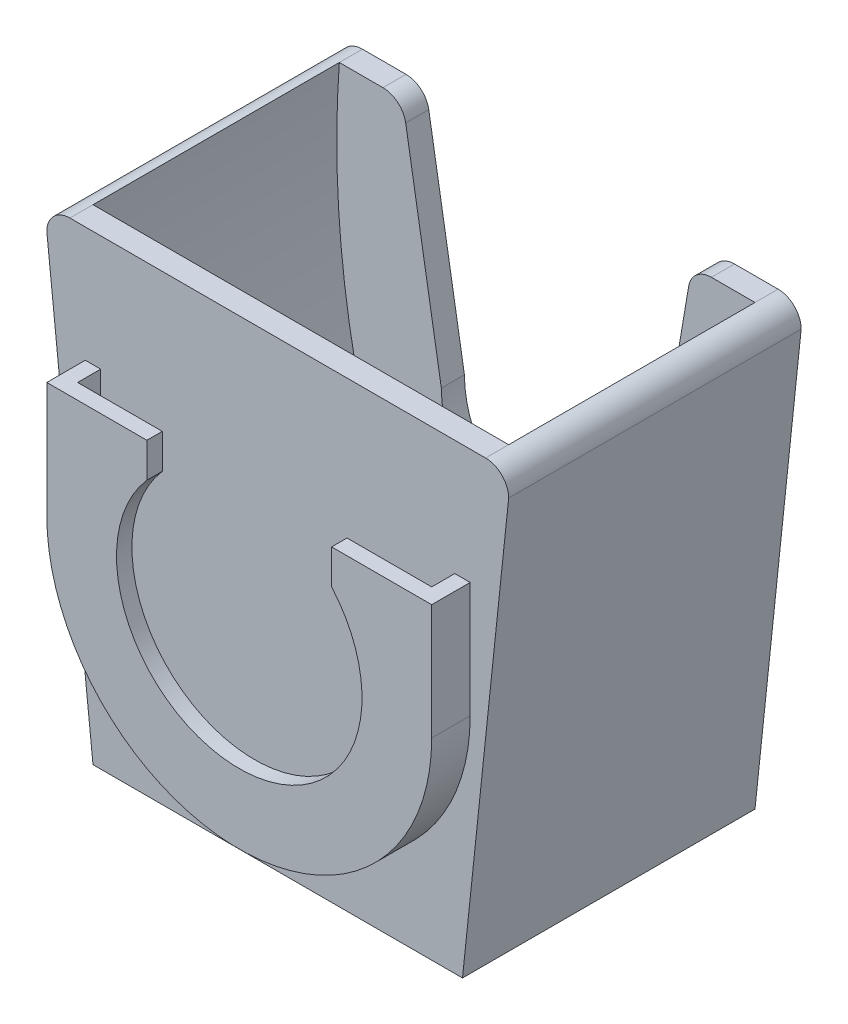
ISO-10303-21;
HEADER;
FILE_DESCRIPTION(('STEP AP214'),'2;1');
FILE_NAME('part.step','',(''),(''),'','','');
FILE_SCHEMA(('AUTOMOTIVE_DESIGN { 1 0 10303 214 1 1 1 1 }'));
ENDSEC;
DATA;
#1=APPLICATION_CONTEXT('core data for automotive mechanical design processes');
#2=APPLICATION_PROTOCOL_DEFINITION('international standard','automotive_design',2000,#1);
#3=PRODUCT_CONTEXT('',#1,'mechanical');
#4=PRODUCT('Part','Part','',(#3));
#5=PRODUCT_RELATED_PRODUCT_CATEGORY('part','',(#4));
#6=PRODUCT_DEFINITION_FORMATION('','',#4);
#7=PRODUCT_DEFINITION_CONTEXT('part definition',#1,'design');
#8=PRODUCT_DEFINITION('design','',#6,#7);
#9=PRODUCT_DEFINITION_SHAPE('','',#8);
#10=(LENGTH_UNIT() NAMED_UNIT(*) SI_UNIT(.MILLI.,.METRE.));
#11=(NAMED_UNIT(*) PLANE_ANGLE_UNIT() SI_UNIT($,.RADIAN.));
#12=(NAMED_UNIT(*) SI_UNIT($,.STERADIAN.) SOLID_ANGLE_UNIT());
#13=UNCERTAINTY_MEASURE_WITH_UNIT(LENGTH_MEASURE(1.E-05),#10,'distance_accuracy_value','');
#14=(GEOMETRIC_REPRESENTATION_CONTEXT(3) GLOBAL_UNCERTAINTY_ASSIGNED_CONTEXT((#13)) GLOBAL_UNIT_ASSIGNED_CONTEXT((#10,
#11,#12)) REPRESENTATION_CONTEXT('',''));
#15=CARTESIAN_POINT('',(0.,0.,0.));
#16=DIRECTION('',(0.,0.,1.));
#17=DIRECTION('',(1.,0.,0.));
#18=AXIS2_PLACEMENT_3D('',#15,#16,#17);
#19=CARTESIAN_POINT('',(0.,0.,23.9999999999997));
#20=DIRECTION('',(0.,0.,1.));
#21=DIRECTION('',(1.,0.,0.));
#22=AXIS2_PLACEMENT_3D('',#19,#20,#21);
#23=PLANE('',#22);
#24=DIRECTION('',(1.,0.,0.));
#25=VECTOR('',#24,1.);
#26=CARTESIAN_POINT('',(-25.0000000000001,14.9999999999998,24.));
#27=LINE('',#26,#25);
#28=CARTESIAN_POINT('',(12.,14.9999999999998,23.9999999999994));
#29=VERTEX_POINT('',#28);
#30=CARTESIAN_POINT('',(24.9999999999999,15.0000000000002,23.9999999999988));
#31=VERTEX_POINT('',#30);
#32=EDGE_CURVE('E276',#29,#31,#27,.T.);
#33=ORIENTED_EDGE('',*,*,#32,.F.);
#34=DIRECTION('',(0.,-1.,0.));
#35=VECTOR('',#34,1.);
#36=CARTESIAN_POINT('',(12.,0.,23.9999999999994));
#37=LINE('',#36,#35);
#38=CARTESIAN_POINT('',(12.,10.4999999999998,23.9999999999994));
#39=VERTEX_POINT('',#38);
#40=EDGE_CURVE('E258',#29,#39,#37,.T.);
#41=ORIENTED_EDGE('',*,*,#40,.T.);
#42=CARTESIAN_POINT('',(0.,0.,23.9999999999997));
#43=DIRECTION('',(0.,0.,1.));
#44=DIRECTION('',(1.,0.,0.));
#45=AXIS2_PLACEMENT_3D('',#42,#43,#44);
#46=CIRCLE('',#45,15.9452187191019);
#47=CARTESIAN_POINT('',(-12.,10.4999999999998,24.));
#48=VERTEX_POINT('',#47);
#49=EDGE_CURVE('E245',#48,#39,#46,.T.);
#50=ORIENTED_EDGE('',*,*,#49,.F.);
#51=DIRECTION('',(0.,-1.,0.));
#52=VECTOR('',#51,1.);
#53=CARTESIAN_POINT('',(-12.,0.,24.));
#54=LINE('',#53,#52);
#55=CARTESIAN_POINT('',(-12.,14.9999999999998,24.));
#56=VERTEX_POINT('',#55);
#57=EDGE_CURVE('E239',#56,#48,#54,.T.);
#58=ORIENTED_EDGE('',*,*,#57,.F.);
#59=CARTESIAN_POINT('',(-25.0000000000001,14.9999999999998,24.));
#60=VERTEX_POINT('',#59);
#61=EDGE_CURVE('E277',#60,#56,#27,.T.);
#62=ORIENTED_EDGE('',*,*,#61,.F.);
#63=DIRECTION('',(0.,-1.,0.));
#64=VECTOR('',#63,1.);
#65=CARTESIAN_POINT('',(-25.0000000000001,14.9999999999998,24.));
#66=LINE('',#65,#64);
#67=CARTESIAN_POINT('',(-25.,0.,24.));
#68=VERTEX_POINT('',#67);
#69=EDGE_CURVE('E327',#60,#68,#66,.T.);
#70=ORIENTED_EDGE('',*,*,#69,.T.);
#71=CARTESIAN_POINT('',(0.,0.,23.9999999999994));
#72=DIRECTION('',(0.,0.,-1.));
#73=DIRECTION('',(-1.,0.,0.));
#74=AXIS2_PLACEMENT_3D('',#71,#72,#73);
#75=CIRCLE('',#74,25.);
#76=CARTESIAN_POINT('',(25.,1.74574066942157E-13,23.9999999999988));
#77=VERTEX_POINT('',#76);
#78=EDGE_CURVE('E356',#77,#68,#75,.T.);
#79=ORIENTED_EDGE('',*,*,#78,.F.);
#80=DIRECTION('',(0.,-1.,0.));
#81=VECTOR('',#80,1.);
#82=CARTESIAN_POINT('',(24.9999999999999,15.0000000000002,23.9999999999988));
#83=LINE('',#82,#81);
#84=EDGE_CURVE('E323',#31,#77,#83,.T.);
#85=ORIENTED_EDGE('',*,*,#84,.F.);
#86=EDGE_LOOP('',(#33,#41,#50,#58,#62,#70,#79,#85));
#87=FACE_BOUND('',#86,.T.);
#88=ADVANCED_FACE('F39',(#87),#23,.T.);
#89=CARTESIAN_POINT('',(22.9999999999999,1.60608141586784E-13,21.9999999999992));
#90=DIRECTION('',(0.,0.,-1.));
#91=DIRECTION('',(-1.,0.,0.));
#92=AXIS2_PLACEMENT_3D('',#89,#90,#91);
#93=PLANE('',#92);
#94=CARTESIAN_POINT('',(0.,0.,21.9999999999997));
#95=DIRECTION('',(0.,0.,1.));
#96=DIRECTION('',(1.,0.,0.));
#97=AXIS2_PLACEMENT_3D('',#94,#95,#96);
#98=CIRCLE('',#97,15.9452187191019);
#99=CARTESIAN_POINT('',(-12.,10.4999999999998,22.));
#100=VERTEX_POINT('',#99);
#101=CARTESIAN_POINT('',(12.,10.4999999999998,21.9999999999994));
#102=VERTEX_POINT('',#101);
#103=EDGE_CURVE('E238',#100,#102,#98,.T.);
#104=ORIENTED_EDGE('',*,*,#103,.T.);
#105=DIRECTION('',(0.,-1.,0.));
#106=VECTOR('',#105,1.);
#107=CARTESIAN_POINT('',(12.,0.,21.9999999999994));
#108=LINE('',#107,#106);
#109=CARTESIAN_POINT('',(12.,14.9999999999998,21.9999999999994));
#110=VERTEX_POINT('',#109);
#111=EDGE_CURVE('E226',#110,#102,#108,.T.);
#112=ORIENTED_EDGE('',*,*,#111,.F.);
#113=DIRECTION('',(-1.,0.,0.));
#114=VECTOR('',#113,1.);
#115=CARTESIAN_POINT('',(22.9999999999998,15.0000000000002,21.9999999999989));
#116=LINE('',#115,#114);
#117=CARTESIAN_POINT('',(22.9999999999998,15.0000000000002,21.9999999999989));
#118=VERTEX_POINT('',#117);
#119=EDGE_CURVE('E293',#118,#110,#116,.T.);
#120=ORIENTED_EDGE('',*,*,#119,.F.);
#121=DIRECTION('',(0.,-1.,0.));
#122=VECTOR('',#121,1.);
#123=CARTESIAN_POINT('',(22.9999999999998,15.0000000000002,21.9999999999989));
#124=LINE('',#123,#122);
#125=CARTESIAN_POINT('',(22.9999999999999,1.60608141586784E-13,21.9999999999989));
#126=VERTEX_POINT('',#125);
#127=EDGE_CURVE('E312',#118,#126,#124,.T.);
#128=ORIENTED_EDGE('',*,*,#127,.T.);
#129=CARTESIAN_POINT('',(0.,0.,21.9999999999994));
#130=DIRECTION('',(0.,0.,-1.));
#131=DIRECTION('',(-1.,0.,0.));
#132=AXIS2_PLACEMENT_3D('',#129,#130,#131);
#133=CIRCLE('',#132,22.9999999999999);
#134=CARTESIAN_POINT('',(-23.,0.,22.));
#135=VERTEX_POINT('',#134);
#136=EDGE_CURVE('E346',#126,#135,#133,.T.);
#137=ORIENTED_EDGE('',*,*,#136,.T.);
#138=DIRECTION('',(0.,-1.,0.));
#139=VECTOR('',#138,1.);
#140=CARTESIAN_POINT('',(-23.0000000000001,14.9999999999998,22.));
#141=LINE('',#140,#139);
#142=CARTESIAN_POINT('',(-23.0000000000001,14.9999999999998,22.));
#143=VERTEX_POINT('',#142);
#144=EDGE_CURVE('E308',#143,#135,#141,.T.);
#145=ORIENTED_EDGE('',*,*,#144,.F.);
#146=CARTESIAN_POINT('',(-12.,14.9999999999999,21.9999999999997));
#147=VERTEX_POINT('',#146);
#148=EDGE_CURVE('E292',#147,#143,#116,.T.);
#149=ORIENTED_EDGE('',*,*,#148,.F.);
#150=DIRECTION('',(0.,-1.,0.));
#151=VECTOR('',#150,1.);
#152=CARTESIAN_POINT('',(-12.,0.,22.));
#153=LINE('',#152,#151);
#154=EDGE_CURVE('E57',#147,#100,#153,.T.);
#155=ORIENTED_EDGE('',*,*,#154,.T.);
#156=EDGE_LOOP('',(#104,#112,#120,#128,#137,#145,#149,#155));
#157=FACE_BOUND('',#156,.T.);
#158=ADVANCED_FACE('F251',(#157),#93,.T.);
#159=CARTESIAN_POINT('',(-1.04744440165294E-13,15.,0.));
#160=DIRECTION('',(0.,1.,0.));
#161=DIRECTION('',(-1.,0.,0.));
#162=AXIS2_PLACEMENT_3D('',#159,#160,#161);
#163=PLANE('',#162);
#164=ORIENTED_EDGE('',*,*,#119,.T.);
#165=DIRECTION('',(0.,0.,1.));
#166=VECTOR('',#165,1.);
#167=CARTESIAN_POINT('',(12.,14.9999999999998,21.9999999999994));
#168=LINE('',#167,#166);
#169=EDGE_CURVE('E232',#110,#29,#168,.T.);
#170=ORIENTED_EDGE('',*,*,#169,.T.);
#171=ORIENTED_EDGE('',*,*,#32,.T.);
#172=DIRECTION('',(0.,0.,-1.));
#173=VECTOR('',#172,1.);
#174=CARTESIAN_POINT('',(24.9999999999999,15.0000000000002,23.9999999999988));
#175=LINE('',#174,#173);
#176=CARTESIAN_POINT('',(24.9999999999999,15.0000000000002,19.));
#177=VERTEX_POINT('',#176);
#178=EDGE_CURVE('E281',#31,#177,#175,.T.);
#179=ORIENTED_EDGE('',*,*,#178,.T.);
#180=DIRECTION('',(-1.,0.,-5.6031568274044E-13));
#181=VECTOR('',#180,1.);
#182=CARTESIAN_POINT('',(24.9999999999999,15.0000000000002,19.));
#183=LINE('',#182,#181);
#184=CARTESIAN_POINT('',(22.9999999999997,15.0000000000002,19.));
#185=VERTEX_POINT('',#184);
#186=EDGE_CURVE('E285',#177,#185,#183,.T.);
#187=ORIENTED_EDGE('',*,*,#186,.T.);
#188=DIRECTION('',(0.,0.,1.));
#189=VECTOR('',#188,1.);
#190=CARTESIAN_POINT('',(22.9999999999997,15.0000000000002,18.9999999999989));
#191=LINE('',#190,#189);
#192=EDGE_CURVE('E289',#185,#118,#191,.T.);
#193=ORIENTED_EDGE('',*,*,#192,.T.);
#194=EDGE_LOOP('',(#164,#170,#171,#179,#187,#193));
#195=FACE_BOUND('',#194,.T.);
#196=ADVANCED_FACE('F617',(#195),#163,.T.);
#197=CARTESIAN_POINT('',(21.3363204338814,27.,19.));
#198=DIRECTION('',(0.,0.,-1.));
#199=DIRECTION('',(-1.,0.,0.));
#200=AXIS2_PLACEMENT_3D('',#197,#198,#199);
#201=PLANE('',#200);
#202=DIRECTION('',(1.,0.,0.));
#203=VECTOR('',#202,1.);
#204=CARTESIAN_POINT('',(21.3363204338814,30.,19.));
#205=LINE('',#204,#203);
#206=CARTESIAN_POINT('',(-27.0000000000002,30.0000000000001,19.));
#207=VERTEX_POINT('',#206);
#208=CARTESIAN_POINT('',(27.,30.,19.));
#209=VERTEX_POINT('',#208);
#210=EDGE_CURVE('E424',#207,#209,#205,.T.);
#211=ORIENTED_EDGE('',*,*,#210,.F.);
#212=CARTESIAN_POINT('',(-27.,27.,19.));
#213=DIRECTION('',(0.,0.,1.));
#214=DIRECTION('',(1.,0.,0.));
#215=AXIS2_PLACEMENT_3D('',#212,#213,#214);
#216=CIRCLE('',#215,3.00000000000012);
#217=CARTESIAN_POINT('',(-30.0000000000002,27.,19.));
#218=VERTEX_POINT('',#217);
#219=EDGE_CURVE('E443',#207,#218,#216,.T.);
#220=ORIENTED_EDGE('',*,*,#219,.T.);
#221=DIRECTION('',(0.104684784518046,-0.994505452921406,0.));
#222=VECTOR('',#221,1.);
#223=CARTESIAN_POINT('',(-30.0000000000002,27.,19.));
#224=LINE('',#223,#222);
#225=CARTESIAN_POINT('',(-24.,-30.,19.));
#226=VERTEX_POINT('',#225);
#227=EDGE_CURVE('E440',#218,#226,#224,.T.);
#228=ORIENTED_EDGE('',*,*,#227,.T.);
#229=DIRECTION('',(1.,0.,0.));
#230=VECTOR('',#229,1.);
#231=CARTESIAN_POINT('',(-24.,-30.,19.));
#232=LINE('',#231,#230);
#233=CARTESIAN_POINT('',(24.,-30.,19.));
#234=VERTEX_POINT('',#233);
#235=EDGE_CURVE('E437',#226,#234,#232,.T.);
#236=ORIENTED_EDGE('',*,*,#235,.T.);
#237=DIRECTION('',(-0.104684784518043,-0.994505452921406,0.));
#238=VECTOR('',#237,1.);
#239=CARTESIAN_POINT('',(30.,27.,19.));
#240=LINE('',#239,#238);
#241=CARTESIAN_POINT('',(30.,27.,19.));
#242=VERTEX_POINT('',#241);
#243=EDGE_CURVE('E433',#242,#234,#240,.T.);
#244=ORIENTED_EDGE('',*,*,#243,.F.);
#245=CARTESIAN_POINT('',(27.,27.,19.));
#246=DIRECTION('',(0.,0.,-1.));
#247=DIRECTION('',(-1.,0.,0.));
#248=AXIS2_PLACEMENT_3D('',#245,#246,#247);
#249=CIRCLE('',#248,3.);
#250=EDGE_CURVE('E428',#209,#242,#249,.T.);
#251=ORIENTED_EDGE('',*,*,#250,.F.);
#252=EDGE_LOOP('',(#211,#220,#228,#236,#244,#251));
#253=FACE_BOUND('',#252,.T.);
#254=DIRECTION('',(0.,-1.,0.));
#255=VECTOR('',#254,1.);
#256=CARTESIAN_POINT('',(-25.0000000000001,14.9999999999998,19.));
#257=LINE('',#256,#255);
#258=CARTESIAN_POINT('',(-25.0000000000001,14.9999999999998,19.));
#259=VERTEX_POINT('',#258);
#260=CARTESIAN_POINT('',(-25.,0.,19.));
#261=VERTEX_POINT('',#260);
#262=EDGE_CURVE('E301',#259,#261,#257,.T.);
#263=ORIENTED_EDGE('',*,*,#262,.F.);
#264=DIRECTION('',(-1.,0.,0.));
#265=VECTOR('',#264,1.);
#266=CARTESIAN_POINT('',(-23.0000000000001,14.9999999999998,19.));
#267=LINE('',#266,#265);
#268=CARTESIAN_POINT('',(-23.0000000000001,14.9999999999998,19.));
#269=VERTEX_POINT('',#268);
#270=EDGE_CURVE('E65',#269,#259,#267,.T.);
#271=ORIENTED_EDGE('',*,*,#270,.F.);
#272=DIRECTION('',(0.,-1.,0.));
#273=VECTOR('',#272,1.);
#274=CARTESIAN_POINT('',(-23.0000000000001,14.9999999999998,19.));
#275=LINE('',#274,#273);
#276=CARTESIAN_POINT('',(-23.,-1.60608141586787E-13,19.));
#277=VERTEX_POINT('',#276);
#278=EDGE_CURVE('E305',#269,#277,#275,.T.);
#279=ORIENTED_EDGE('',*,*,#278,.T.);
#280=CARTESIAN_POINT('',(-1.21347784781828E-13,0.,18.9999999999994));
#281=DIRECTION('',(0.,0.,-1.));
#282=DIRECTION('',(-1.,0.,0.));
#283=AXIS2_PLACEMENT_3D('',#280,#281,#282);
#284=CIRCLE('',#283,22.9999999999999);
#285=CARTESIAN_POINT('',(22.9999999999998,1.60608141586783E-13,18.9999999999989));
#286=VERTEX_POINT('',#285);
#287=EDGE_CURVE('E349',#286,#277,#284,.T.);
#288=ORIENTED_EDGE('',*,*,#287,.F.);
#289=DIRECTION('',(0.,-1.,0.));
#290=VECTOR('',#289,1.);
#291=CARTESIAN_POINT('',(22.9999999999997,15.0000000000002,18.9999999999989));
#292=LINE('',#291,#290);
#293=EDGE_CURVE('E316',#185,#286,#292,.T.);
#294=ORIENTED_EDGE('',*,*,#293,.F.);
#295=ORIENTED_EDGE('',*,*,#186,.F.);
#296=DIRECTION('',(0.,-1.,0.));
#297=VECTOR('',#296,1.);
#298=CARTESIAN_POINT('',(24.9999999999999,15.0000000000002,19.));
#299=LINE('',#298,#297);
#300=CARTESIAN_POINT('',(25.,1.74769556607212E-13,19.));
#301=VERTEX_POINT('',#300);
#302=EDGE_CURVE('E320',#177,#301,#299,.T.);
#303=ORIENTED_EDGE('',*,*,#302,.T.);
#304=CARTESIAN_POINT('',(-1.21347784781829E-13,0.,18.9999999999994));
#305=DIRECTION('',(0.,0.,-1.));
#306=DIRECTION('',(-1.,0.,0.));
#307=AXIS2_PLACEMENT_3D('',#304,#305,#306);
#308=CIRCLE('',#307,24.9999999999999);
#309=EDGE_CURVE('E352',#301,#261,#308,.T.);
#310=ORIENTED_EDGE('',*,*,#309,.T.);
#311=EDGE_LOOP('',(#263,#271,#279,#288,#294,#295,#303,#310));
#312=FACE_BOUND('',#311,.T.);
#313=ADVANCED_FACE('F731',(#253,#312),#201,.F.);
#314=CARTESIAN_POINT('',(21.3363204338814,30.,19.));
#315=DIRECTION('',(0.,1.,0.));
#316=DIRECTION('',(0.,0.,1.));
#317=AXIS2_PLACEMENT_3D('',#314,#315,#316);
#318=PLANE('',#317);
#319=DIRECTION('',(0.,0.,-1.));
#320=VECTOR('',#319,1.);
#321=CARTESIAN_POINT('',(27.,30.,19.));
#322=LINE('',#321,#320);
#323=CARTESIAN_POINT('',(27.,30.,16.));
#324=VERTEX_POINT('',#323);
#325=EDGE_CURVE('E519',#209,#324,#322,.T.);
#326=ORIENTED_EDGE('',*,*,#325,.T.);
#327=DIRECTION('',(-1.,0.,0.));
#328=VECTOR('',#327,1.);
#329=CARTESIAN_POINT('',(27.,30.,16.));
#330=LINE('',#329,#328);
#331=CARTESIAN_POINT('',(-27.,30.,16.));
#332=VERTEX_POINT('',#331);
#333=EDGE_CURVE('E386',#324,#332,#330,.T.);
#334=ORIENTED_EDGE('',*,*,#333,.T.);
#335=DIRECTION('',(0.,0.,-1.));
#336=VECTOR('',#335,1.);
#337=CARTESIAN_POINT('',(-27.0000000000002,30.0000000000001,19.));
#338=LINE('',#337,#336);
#339=EDGE_CURVE('E501',#207,#332,#338,.T.);
#340=ORIENTED_EDGE('',*,*,#339,.F.);
#341=ORIENTED_EDGE('',*,*,#210,.T.);
#342=EDGE_LOOP('',(#326,#334,#340,#341));
#343=FACE_BOUND('',#342,.T.);
#344=ADVANCED_FACE('F598',(#343),#318,.T.);
#345=CARTESIAN_POINT('',(21.3363204338814,27.,19.));
#346=DIRECTION('',(0.,0.,-1.));
#347=DIRECTION('',(-1.,0.,0.));
#348=AXIS2_PLACEMENT_3D('',#345,#346,#347);
#349=CYLINDRICAL_SURFACE('',#348,3.);
#350=CARTESIAN_POINT('',(21.3363204338814,27.,-16.));
#351=DIRECTION('',(0.,0.,-1.));
#352=DIRECTION('',(-1.,0.,0.));
#353=AXIS2_PLACEMENT_3D('',#350,#351,#352);
#354=CIRCLE('',#353,3.);
#355=CARTESIAN_POINT('',(21.3363204338814,30.,-16.));
#356=VERTEX_POINT('',#355);
#357=CARTESIAN_POINT('',(18.377926496154,27.4979009030093,-16.));
#358=VERTEX_POINT('',#357);
#359=EDGE_CURVE('E420',#356,#358,#354,.F.);
#360=ORIENTED_EDGE('',*,*,#359,.F.);
#361=DIRECTION('',(0.,0.,-1.));
#362=VECTOR('',#361,1.);
#363=CARTESIAN_POINT('',(21.3363204338814,30.,19.));
#364=LINE('',#363,#362);
#365=CARTESIAN_POINT('',(21.3363204338814,30.,-19.));
#366=VERTEX_POINT('',#365);
#367=EDGE_CURVE('E43',#356,#366,#364,.T.);
#368=ORIENTED_EDGE('',*,*,#367,.T.);
#369=CARTESIAN_POINT('',(21.3363204338814,27.,-19.));
#370=DIRECTION('',(0.,0.,-1.));
#371=DIRECTION('',(-1.,0.,0.));
#372=AXIS2_PLACEMENT_3D('',#369,#370,#371);
#373=CIRCLE('',#372,3.);
#374=CARTESIAN_POINT('',(18.377926496154,27.4979009030093,-19.));
#375=VERTEX_POINT('',#374);
#376=EDGE_CURVE('E423',#375,#366,#373,.T.);
#377=ORIENTED_EDGE('',*,*,#376,.F.);
#378=DIRECTION('',(0.,0.,-1.));
#379=VECTOR('',#378,1.);
#380=CARTESIAN_POINT('',(18.377926496154,27.4979009030093,19.));
#381=LINE('',#380,#379);
#382=EDGE_CURVE('E11',#358,#375,#381,.T.);
#383=ORIENTED_EDGE('',*,*,#382,.F.);
#384=EDGE_LOOP('',(#360,#368,#377,#383));
#385=FACE_BOUND('',#384,.T.);
#386=ADVANCED_FACE('F41',(#385),#349,.T.);
#387=CARTESIAN_POINT('',(18.377926496154,27.4979009030093,19.));
#388=DIRECTION('',(0.986131312575814,-0.165966967669784,0.));
#389=DIRECTION('',(0.165966967669784,0.986131312575814,0.));
#390=AXIS2_PLACEMENT_3D('',#387,#388,#389);
#391=PLANE('',#390);
#392=DIRECTION('',(0.,0.,-1.));
#393=VECTOR('',#392,1.);
#394=CARTESIAN_POINT('',(13.75,0.,19.));
#395=LINE('',#394,#393);
#396=CARTESIAN_POINT('',(13.75,0.,-16.));
#397=VERTEX_POINT('',#396);
#398=CARTESIAN_POINT('',(13.75,0.,-19.));
#399=VERTEX_POINT('',#398);
#400=EDGE_CURVE('E49',#397,#399,#395,.T.);
#401=ORIENTED_EDGE('',*,*,#400,.F.);
#402=DIRECTION('',(0.165966967669784,0.986131312575814,0.));
#403=VECTOR('',#402,1.);
#404=CARTESIAN_POINT('',(18.377926496154,27.4979009030093,-16.));
#405=LINE('',#404,#403);
#406=EDGE_CURVE('E416',#397,#358,#405,.T.);
#407=ORIENTED_EDGE('',*,*,#406,.T.);
#408=ORIENTED_EDGE('',*,*,#382,.T.);
#409=DIRECTION('',(-0.165966967669784,-0.986131312575814,0.));
#410=VECTOR('',#409,1.);
#411=CARTESIAN_POINT('',(18.377926496154,27.4979009030093,-19.));
#412=LINE('',#411,#410);
#413=EDGE_CURVE('E429',#375,#399,#412,.T.);
#414=ORIENTED_EDGE('',*,*,#413,.T.);
#415=EDGE_LOOP('',(#401,#407,#408,#414));
#416=FACE_BOUND('',#415,.T.);
#417=ADVANCED_FACE('F543',(#416),#391,.F.);
#418=CARTESIAN_POINT('',(0.,0.,19.));
#419=DIRECTION('',(0.,0.,-1.));
#420=DIRECTION('',(-1.,0.,0.));
#421=AXIS2_PLACEMENT_3D('',#418,#419,#420);
#422=CYLINDRICAL_SURFACE('',#421,13.75);
#423=CARTESIAN_POINT('',(0.,0.,-16.));
#424=DIRECTION('',(0.,0.,-1.));
#425=DIRECTION('',(-1.,0.,0.));
#426=AXIS2_PLACEMENT_3D('',#423,#424,#425);
#427=CIRCLE('',#426,13.75);
#428=CARTESIAN_POINT('',(-13.75,0.,-16.));
#429=VERTEX_POINT('',#428);
#430=EDGE_CURVE('E368',#397,#429,#427,.T.);
#431=ORIENTED_EDGE('',*,*,#430,.F.);
#432=ORIENTED_EDGE('',*,*,#400,.T.);
#433=CARTESIAN_POINT('',(0.,0.,-19.));
#434=DIRECTION('',(0.,0.,1.));
#435=DIRECTION('',(1.,0.,0.));
#436=AXIS2_PLACEMENT_3D('',#433,#434,#435);
#437=CIRCLE('',#436,13.75);
#438=CARTESIAN_POINT('',(-13.75,0.,-19.));
#439=VERTEX_POINT('',#438);
#440=EDGE_CURVE('E483',#439,#399,#437,.T.);
#441=ORIENTED_EDGE('',*,*,#440,.F.);
#442=DIRECTION('',(0.,0.,-1.));
#443=VECTOR('',#442,1.);
#444=CARTESIAN_POINT('',(-13.75,0.,19.));
#445=LINE('',#444,#443);
#446=EDGE_CURVE('E492',#429,#439,#445,.T.);
#447=ORIENTED_EDGE('',*,*,#446,.F.);
#448=EDGE_LOOP('',(#431,#432,#441,#447));
#449=FACE_BOUND('',#448,.T.);
#450=ADVANCED_FACE('F550',(#449),#422,.F.);
#451=CARTESIAN_POINT('',(-18.3779264961539,27.4979009030093,19.));
#452=DIRECTION('',(0.986131312575814,0.165966967669784,0.));
#453=DIRECTION('',(-0.165966967669784,0.986131312575814,0.));
#454=AXIS2_PLACEMENT_3D('',#451,#452,#453);
#455=PLANE('',#454);
#456=DIRECTION('',(-0.165966967669784,0.986131312575814,0.));
#457=VECTOR('',#456,1.);
#458=CARTESIAN_POINT('',(-18.3779264961539,27.4979009030093,-16.));
#459=LINE('',#458,#457);
#460=CARTESIAN_POINT('',(-18.3779264961539,27.4979009030093,-16.));
#461=VERTEX_POINT('',#460);
#462=EDGE_CURVE('E413',#429,#461,#459,.T.);
#463=ORIENTED_EDGE('',*,*,#462,.F.);
#464=ORIENTED_EDGE('',*,*,#446,.T.);
#465=DIRECTION('',(0.165966967669784,-0.986131312575814,0.));
#466=VECTOR('',#465,1.);
#467=CARTESIAN_POINT('',(-18.3779264961539,27.4979009030093,-19.));
#468=LINE('',#467,#466);
#469=CARTESIAN_POINT('',(-18.3779264961539,27.4979009030093,-19.));
#470=VERTEX_POINT('',#469);
#471=EDGE_CURVE('E479',#470,#439,#468,.T.);
#472=ORIENTED_EDGE('',*,*,#471,.F.);
#473=DIRECTION('',(0.,0.,-1.));
#474=VECTOR('',#473,1.);
#475=CARTESIAN_POINT('',(-18.3779264961539,27.4979009030093,19.));
#476=LINE('',#475,#474);
#477=EDGE_CURVE('E495',#461,#470,#476,.T.);
#478=ORIENTED_EDGE('',*,*,#477,.F.);
#479=EDGE_LOOP('',(#463,#464,#472,#478));
#480=FACE_BOUND('',#479,.T.);
#481=ADVANCED_FACE('F553',(#480),#455,.T.);
#482=CARTESIAN_POINT('',(-21.3363204338814,27.,19.));
#483=DIRECTION('',(0.,0.,-1.));
#484=DIRECTION('',(-1.,0.,0.));
#485=AXIS2_PLACEMENT_3D('',#482,#483,#484);
#486=CYLINDRICAL_SURFACE('',#485,3.);
#487=CARTESIAN_POINT('',(-21.3363204338814,27.,-16.));
#488=DIRECTION('',(0.,0.,-1.));
#489=DIRECTION('',(-1.,0.,0.));
#490=AXIS2_PLACEMENT_3D('',#487,#488,#489);
#491=CIRCLE('',#490,3.);
#492=CARTESIAN_POINT('',(-21.3363204338814,30.,-16.));
#493=VERTEX_POINT('',#492);
#494=EDGE_CURVE('E399',#461,#493,#491,.F.);
#495=ORIENTED_EDGE('',*,*,#494,.F.);
#496=ORIENTED_EDGE('',*,*,#477,.T.);
#497=CARTESIAN_POINT('',(-21.3363204338814,27.,-19.));
#498=DIRECTION('',(0.,0.,-1.));
#499=DIRECTION('',(-1.,0.,0.));
#500=AXIS2_PLACEMENT_3D('',#497,#498,#499);
#501=CIRCLE('',#500,3.);
#502=CARTESIAN_POINT('',(-21.3363204338814,30.,-19.));
#503=VERTEX_POINT('',#502);
#504=EDGE_CURVE('E475',#503,#470,#501,.T.);
#505=ORIENTED_EDGE('',*,*,#504,.F.);
#506=DIRECTION('',(0.,0.,-1.));
#507=VECTOR('',#506,1.);
#508=CARTESIAN_POINT('',(-21.3363204338814,30.,19.));
#509=LINE('',#508,#507);
#510=EDGE_CURVE('E498',#493,#503,#509,.T.);
#511=ORIENTED_EDGE('',*,*,#510,.F.);
#512=EDGE_LOOP('',(#495,#496,#505,#511));
#513=FACE_BOUND('',#512,.T.);
#514=ADVANCED_FACE('F559',(#513),#486,.T.);
#515=CARTESIAN_POINT('',(-27.0000000000002,30.,19.));
#516=DIRECTION('',(0.,1.,0.));
#517=DIRECTION('',(-1.,0.,0.));
#518=AXIS2_PLACEMENT_3D('',#515,#516,#517);
#519=PLANE('',#518);
#520=DIRECTION('',(-1.,0.,0.));
#521=VECTOR('',#520,1.);
#522=CARTESIAN_POINT('',(-27.,30.,-16.));
#523=LINE('',#522,#521);
#524=CARTESIAN_POINT('',(-27.,30.,-16.));
#525=VERTEX_POINT('',#524);
#526=EDGE_CURVE('E371',#493,#525,#523,.T.);
#527=ORIENTED_EDGE('',*,*,#526,.F.);
#528=ORIENTED_EDGE('',*,*,#510,.T.);
#529=DIRECTION('',(1.,0.,0.));
#530=VECTOR('',#529,1.);
#531=CARTESIAN_POINT('',(-27.0000000000002,30.,-19.));
#532=LINE('',#531,#530);
#533=CARTESIAN_POINT('',(-27.0000000000002,30.0000000000001,-19.));
#534=VERTEX_POINT('',#533);
#535=EDGE_CURVE('E471',#534,#503,#532,.T.);
#536=ORIENTED_EDGE('',*,*,#535,.F.);
#537=EDGE_CURVE('E505',#525,#534,#338,.T.);
#538=ORIENTED_EDGE('',*,*,#537,.F.);
#539=EDGE_LOOP('',(#527,#528,#536,#538));
#540=FACE_BOUND('',#539,.T.);
#541=ADVANCED_FACE('F563',(#540),#519,.T.);
#542=CARTESIAN_POINT('',(-27.,27.,19.));
#543=DIRECTION('',(0.,0.,-1.));
#544=DIRECTION('',(-1.,0.,0.));
#545=AXIS2_PLACEMENT_3D('',#542,#543,#544);
#546=CYLINDRICAL_SURFACE('',#545,3.00000000000012);
#547=CARTESIAN_POINT('',(-27.,27.,-19.));
#548=DIRECTION('',(0.,0.,1.));
#549=DIRECTION('',(1.,0.,0.));
#550=AXIS2_PLACEMENT_3D('',#547,#548,#549);
#551=CIRCLE('',#550,3.00000000000012);
#552=CARTESIAN_POINT('',(-30.0000000000002,27.,-19.));
#553=VERTEX_POINT('',#552);
#554=EDGE_CURVE('E468',#534,#553,#551,.T.);
#555=ORIENTED_EDGE('',*,*,#554,.T.);
#556=DIRECTION('',(0.,0.,-1.));
#557=VECTOR('',#556,1.);
#558=CARTESIAN_POINT('',(-30.0000000000002,27.,19.));
#559=LINE('',#558,#557);
#560=EDGE_CURVE('E506',#218,#553,#559,.T.);
#561=ORIENTED_EDGE('',*,*,#560,.F.);
#562=ORIENTED_EDGE('',*,*,#219,.F.);
#563=ORIENTED_EDGE('',*,*,#339,.T.);
#564=DIRECTION('',(0.,0.,1.));
#565=VECTOR('',#564,1.);
#566=CARTESIAN_POINT('',(-27.,30.,-16.));
#567=LINE('',#566,#565);
#568=EDGE_CURVE('E404',#525,#332,#567,.T.);
#569=ORIENTED_EDGE('',*,*,#568,.F.);
#570=ORIENTED_EDGE('',*,*,#537,.T.);
#571=EDGE_LOOP('',(#555,#561,#562,#563,#569,#570));
#572=FACE_BOUND('',#571,.T.);
#573=ADVANCED_FACE('F594',(#572),#546,.T.);
#574=CARTESIAN_POINT('',(-30.0000000000002,27.,19.));
#575=DIRECTION('',(0.994505452921406,0.104684784518046,0.));
#576=DIRECTION('',(-0.104684784518046,0.994505452921406,0.));
#577=AXIS2_PLACEMENT_3D('',#574,#575,#576);
#578=PLANE('',#577);
#579=DIRECTION('',(0.104684784518046,-0.994505452921406,0.));
#580=VECTOR('',#579,1.);
#581=CARTESIAN_POINT('',(-30.0000000000002,27.,-19.));
#582=LINE('',#581,#580);
#583=CARTESIAN_POINT('',(-24.,-30.,-19.));
#584=VERTEX_POINT('',#583);
#585=EDGE_CURVE('E465',#553,#584,#582,.T.);
#586=ORIENTED_EDGE('',*,*,#585,.T.);
#587=DIRECTION('',(0.,0.,-1.));
#588=VECTOR('',#587,1.);
#589=CARTESIAN_POINT('',(-24.,-30.,19.));
#590=LINE('',#589,#588);
#591=EDGE_CURVE('E510',#226,#584,#590,.T.);
#592=ORIENTED_EDGE('',*,*,#591,.F.);
#593=ORIENTED_EDGE('',*,*,#227,.F.);
#594=ORIENTED_EDGE('',*,*,#560,.T.);
#595=EDGE_LOOP('',(#586,#592,#593,#594));
#596=FACE_BOUND('',#595,.T.);
#597=ADVANCED_FACE('F590',(#596),#578,.F.);
#598=CARTESIAN_POINT('',(-24.,-30.,19.));
#599=DIRECTION('',(0.,1.,0.));
#600=DIRECTION('',(0.,0.,1.));
#601=AXIS2_PLACEMENT_3D('',#598,#599,#600);
#602=PLANE('',#601);
#603=DIRECTION('',(0.,0.,1.));
#604=VECTOR('',#603,1.);
#605=CARTESIAN_POINT('',(16.,-30.,-16.));
#606=LINE('',#605,#604);
#607=CARTESIAN_POINT('',(16.,-30.,-16.));
#608=VERTEX_POINT('',#607);
#609=CARTESIAN_POINT('',(16.,-30.,16.));
#610=VERTEX_POINT('',#609);
#611=EDGE_CURVE('E395',#608,#610,#606,.T.);
#612=ORIENTED_EDGE('',*,*,#611,.F.);
#613=DIRECTION('',(1.,0.,0.));
#614=VECTOR('',#613,1.);
#615=CARTESIAN_POINT('',(16.,-30.,-16.));
#616=LINE('',#615,#614);
#617=CARTESIAN_POINT('',(-16.,-30.,-16.));
#618=VERTEX_POINT('',#617);
#619=EDGE_CURVE('E378',#618,#608,#616,.T.);
#620=ORIENTED_EDGE('',*,*,#619,.F.);
#621=DIRECTION('',(0.,0.,1.));
#622=VECTOR('',#621,1.);
#623=CARTESIAN_POINT('',(-16.,-30.,-16.));
#624=LINE('',#623,#622);
#625=CARTESIAN_POINT('',(-16.,-30.,16.));
#626=VERTEX_POINT('',#625);
#627=EDGE_CURVE('E400',#618,#626,#624,.T.);
#628=ORIENTED_EDGE('',*,*,#627,.T.);
#629=DIRECTION('',(1.,0.,0.));
#630=VECTOR('',#629,1.);
#631=CARTESIAN_POINT('',(16.,-30.,16.));
#632=LINE('',#631,#630);
#633=EDGE_CURVE('E365',#626,#610,#632,.T.);
#634=ORIENTED_EDGE('',*,*,#633,.T.);
#635=EDGE_LOOP('',(#612,#620,#628,#634));
#636=FACE_BOUND('',#635,.T.);
#637=DIRECTION('',(1.,0.,0.));
#638=VECTOR('',#637,1.);
#639=CARTESIAN_POINT('',(-24.,-30.,-19.));
#640=LINE('',#639,#638);
#641=CARTESIAN_POINT('',(24.,-30.,-19.));
#642=VERTEX_POINT('',#641);
#643=EDGE_CURVE('E461',#584,#642,#640,.T.);
#644=ORIENTED_EDGE('',*,*,#643,.T.);
#645=DIRECTION('',(0.,0.,-1.));
#646=VECTOR('',#645,1.);
#647=CARTESIAN_POINT('',(24.,-30.,19.));
#648=LINE('',#647,#646);
#649=EDGE_CURVE('E514',#234,#642,#648,.T.);
#650=ORIENTED_EDGE('',*,*,#649,.F.);
#651=ORIENTED_EDGE('',*,*,#235,.F.);
#652=ORIENTED_EDGE('',*,*,#591,.T.);
#653=EDGE_LOOP('',(#644,#650,#651,#652));
#654=FACE_BOUND('',#653,.T.);
#655=ADVANCED_FACE('F574',(#636,#654),#602,.F.);
#656=CARTESIAN_POINT('',(30.,27.,19.));
#657=DIRECTION('',(0.994505452921406,-0.104684784518043,0.));
#658=DIRECTION('',(0.104684784518043,0.994505452921406,0.));
#659=AXIS2_PLACEMENT_3D('',#656,#657,#658);
#660=PLANE('',#659);
#661=DIRECTION('',(-0.104684784518043,-0.994505452921406,0.));
#662=VECTOR('',#661,1.);
#663=CARTESIAN_POINT('',(30.,27.,-19.));
#664=LINE('',#663,#662);
#665=CARTESIAN_POINT('',(30.,27.,-19.));
#666=VERTEX_POINT('',#665);
#667=EDGE_CURVE('E457',#666,#642,#664,.T.);
#668=ORIENTED_EDGE('',*,*,#667,.F.);
#669=DIRECTION('',(0.,0.,-1.));
#670=VECTOR('',#669,1.);
#671=CARTESIAN_POINT('',(30.,27.,19.));
#672=LINE('',#671,#670);
#673=EDGE_CURVE('E517',#242,#666,#672,.T.);
#674=ORIENTED_EDGE('',*,*,#673,.F.);
#675=ORIENTED_EDGE('',*,*,#243,.T.);
#676=ORIENTED_EDGE('',*,*,#649,.T.);
#677=EDGE_LOOP('',(#668,#674,#675,#676));
#678=FACE_BOUND('',#677,.T.);
#679=ADVANCED_FACE('F583',(#678),#660,.T.);
#680=CARTESIAN_POINT('',(27.,27.,19.));
#681=DIRECTION('',(0.,0.,-1.));
#682=DIRECTION('',(-1.,0.,0.));
#683=AXIS2_PLACEMENT_3D('',#680,#681,#682);
#684=CYLINDRICAL_SURFACE('',#683,3.);
#685=CARTESIAN_POINT('',(27.,27.,-19.));
#686=DIRECTION('',(0.,0.,-1.));
#687=DIRECTION('',(-1.,0.,0.));
#688=AXIS2_PLACEMENT_3D('',#685,#686,#687);
#689=CIRCLE('',#688,3.);
#690=CARTESIAN_POINT('',(27.,30.,-19.));
#691=VERTEX_POINT('',#690);
#692=EDGE_CURVE('E453',#691,#666,#689,.T.);
#693=ORIENTED_EDGE('',*,*,#692,.F.);
#694=CARTESIAN_POINT('',(27.,30.,-16.));
#695=VERTEX_POINT('',#694);
#696=EDGE_CURVE('E522',#695,#691,#322,.T.);
#697=ORIENTED_EDGE('',*,*,#696,.F.);
#698=DIRECTION('',(0.,0.,1.));
#699=VECTOR('',#698,1.);
#700=CARTESIAN_POINT('',(27.,30.,-16.));
#701=LINE('',#700,#699);
#702=EDGE_CURVE('E382',#695,#324,#701,.T.);
#703=ORIENTED_EDGE('',*,*,#702,.T.);
#704=ORIENTED_EDGE('',*,*,#325,.F.);
#705=ORIENTED_EDGE('',*,*,#250,.T.);
#706=ORIENTED_EDGE('',*,*,#673,.T.);
#707=EDGE_LOOP('',(#693,#697,#703,#704,#705,#706));
#708=FACE_BOUND('',#707,.T.);
#709=ADVANCED_FACE('F578',(#708),#684,.T.);
#710=DIRECTION('',(-1.,0.,0.));
#711=VECTOR('',#710,1.);
#712=CARTESIAN_POINT('',(27.,30.,-16.));
#713=LINE('',#712,#711);
#714=EDGE_CURVE('E364',#695,#356,#713,.T.);
#715=ORIENTED_EDGE('',*,*,#714,.F.);
#716=ORIENTED_EDGE('',*,*,#696,.T.);
#717=DIRECTION('',(1.,0.,0.));
#718=VECTOR('',#717,1.);
#719=CARTESIAN_POINT('',(21.3363204338814,30.,-19.));
#720=LINE('',#719,#718);
#721=EDGE_CURVE('E449',#366,#691,#720,.T.);
#722=ORIENTED_EDGE('',*,*,#721,.F.);
#723=ORIENTED_EDGE('',*,*,#367,.F.);
#724=EDGE_LOOP('',(#715,#716,#722,#723));
#725=FACE_BOUND('',#724,.T.);
#726=ADVANCED_FACE('F536',(#725),#318,.T.);
#727=CARTESIAN_POINT('',(21.3363204338814,27.,-19.));
#728=DIRECTION('',(0.,0.,-1.));
#729=DIRECTION('',(-1.,0.,0.));
#730=AXIS2_PLACEMENT_3D('',#727,#728,#729);
#731=PLANE('',#730);
#732=ORIENTED_EDGE('',*,*,#376,.T.);
#733=ORIENTED_EDGE('',*,*,#721,.T.);
#734=ORIENTED_EDGE('',*,*,#692,.T.);
#735=ORIENTED_EDGE('',*,*,#667,.T.);
#736=ORIENTED_EDGE('',*,*,#643,.F.);
#737=ORIENTED_EDGE('',*,*,#585,.F.);
#738=ORIENTED_EDGE('',*,*,#554,.F.);
#739=ORIENTED_EDGE('',*,*,#535,.T.);
#740=ORIENTED_EDGE('',*,*,#504,.T.);
#741=ORIENTED_EDGE('',*,*,#471,.T.);
#742=ORIENTED_EDGE('',*,*,#440,.T.);
#743=ORIENTED_EDGE('',*,*,#413,.F.);
#744=EDGE_LOOP('',(#732,#733,#734,#735,#736,#737,#738,#739,#740,#741,#742,#743));
#745=FACE_BOUND('',#744,.T.);
#746=ADVANCED_FACE('F539',(#745),#731,.T.);
#747=CARTESIAN_POINT('',(-93.3006915986689,21.0467934597559,-16.));
#748=DIRECTION('',(0.,0.,1.));
#749=DIRECTION('',(1.,0.,0.));
#750=AXIS2_PLACEMENT_3D('',#747,#748,#749);
#751=CYLINDRICAL_SURFACE('',#750,120.633396314911);
#752=CARTESIAN_POINT('',(-93.3006915986689,21.0467934597559,16.));
#753=DIRECTION('',(0.,0.,1.));
#754=DIRECTION('',(-1.,0.,0.));
#755=AXIS2_PLACEMENT_3D('',#752,#753,#754);
#756=CIRCLE('',#755,120.633396314911);
#757=EDGE_CURVE('E359',#610,#324,#756,.T.);
#758=ORIENTED_EDGE('',*,*,#757,.T.);
#759=ORIENTED_EDGE('',*,*,#702,.F.);
#760=CARTESIAN_POINT('',(-93.3006915986689,21.0467934597559,-16.));
#761=DIRECTION('',(0.,0.,1.));
#762=DIRECTION('',(-1.,0.,0.));
#763=AXIS2_PLACEMENT_3D('',#760,#761,#762);
#764=CIRCLE('',#763,120.633396314911);
#765=EDGE_CURVE('E360',#608,#695,#764,.T.);
#766=ORIENTED_EDGE('',*,*,#765,.F.);
#767=ORIENTED_EDGE('',*,*,#611,.T.);
#768=EDGE_LOOP('',(#758,#759,#766,#767));
#769=FACE_BOUND('',#768,.T.);
#770=ADVANCED_FACE('F601',(#769),#751,.F.);
#771=CARTESIAN_POINT('',(93.3006915986689,21.0467934597559,-16.));
#772=DIRECTION('',(0.,0.,1.));
#773=DIRECTION('',(1.,0.,0.));
#774=AXIS2_PLACEMENT_3D('',#771,#772,#773);
#775=CYLINDRICAL_SURFACE('',#774,120.633396314911);
#776=CARTESIAN_POINT('',(93.3006915986689,21.0467934597559,16.));
#777=DIRECTION('',(0.,0.,1.));
#778=DIRECTION('',(1.,0.,0.));
#779=AXIS2_PLACEMENT_3D('',#776,#777,#778);
#780=CIRCLE('',#779,120.633396314911);
#781=EDGE_CURVE('E389',#332,#626,#780,.T.);
#782=ORIENTED_EDGE('',*,*,#781,.T.);
#783=ORIENTED_EDGE('',*,*,#627,.F.);
#784=CARTESIAN_POINT('',(93.3006915986689,21.0467934597559,-16.));
#785=DIRECTION('',(0.,0.,1.));
#786=DIRECTION('',(1.,0.,0.));
#787=AXIS2_PLACEMENT_3D('',#784,#785,#786);
#788=CIRCLE('',#787,120.633396314911);
#789=EDGE_CURVE('E374',#525,#618,#788,.T.);
#790=ORIENTED_EDGE('',*,*,#789,.F.);
#791=ORIENTED_EDGE('',*,*,#568,.T.);
#792=EDGE_LOOP('',(#782,#783,#790,#791));
#793=FACE_BOUND('',#792,.T.);
#794=ADVANCED_FACE('F569',(#793),#775,.F.);
#795=CARTESIAN_POINT('',(-93.3006915986689,21.0467934597559,-16.));
#796=DIRECTION('',(0.,0.,-1.));
#797=DIRECTION('',(-1.,0.,0.));
#798=AXIS2_PLACEMENT_3D('',#795,#796,#797);
#799=PLANE('',#798);
#800=ORIENTED_EDGE('',*,*,#359,.T.);
#801=ORIENTED_EDGE('',*,*,#406,.F.);
#802=ORIENTED_EDGE('',*,*,#430,.T.);
#803=ORIENTED_EDGE('',*,*,#462,.T.);
#804=ORIENTED_EDGE('',*,*,#494,.T.);
#805=ORIENTED_EDGE('',*,*,#526,.T.);
#806=ORIENTED_EDGE('',*,*,#789,.T.);
#807=ORIENTED_EDGE('',*,*,#619,.T.);
#808=ORIENTED_EDGE('',*,*,#765,.T.);
#809=ORIENTED_EDGE('',*,*,#714,.T.);
#810=EDGE_LOOP('',(#800,#801,#802,#803,#804,#805,#806,#807,#808,#809));
#811=FACE_BOUND('',#810,.T.);
#812=ADVANCED_FACE('F546',(#811),#799,.F.);
#813=CARTESIAN_POINT('',(-93.3006915986689,21.0467934597559,16.));
#814=DIRECTION('',(0.,0.,-1.));
#815=DIRECTION('',(-1.,0.,0.));
#816=AXIS2_PLACEMENT_3D('',#813,#814,#815);
#817=PLANE('',#816);
#818=ORIENTED_EDGE('',*,*,#781,.F.);
#819=ORIENTED_EDGE('',*,*,#333,.F.);
#820=ORIENTED_EDGE('',*,*,#757,.F.);
#821=ORIENTED_EDGE('',*,*,#633,.F.);
#822=EDGE_LOOP('',(#818,#819,#820,#821));
#823=FACE_BOUND('',#822,.T.);
#824=ADVANCED_FACE('F600',(#823),#817,.T.);
#825=CARTESIAN_POINT('',(0.,0.,22.));
#826=DIRECTION('',(0.,0.,-1.));
#827=DIRECTION('',(-1.,0.,0.));
#828=AXIS2_PLACEMENT_3D('',#825,#826,#827);
#829=CYLINDRICAL_SURFACE('',#828,24.9999999999999);
#830=ORIENTED_EDGE('',*,*,#309,.F.);
#831=DIRECTION('',(0.,0.,1.));
#832=VECTOR('',#831,1.);
#833=CARTESIAN_POINT('',(25.,1.74574066942157E-13,23.9999999999988));
#834=LINE('',#833,#832);
#835=EDGE_CURVE('E342',#301,#77,#834,.T.);
#836=ORIENTED_EDGE('',*,*,#835,.T.);
#837=ORIENTED_EDGE('',*,*,#78,.T.);
#838=DIRECTION('',(0.,0.,1.));
#839=VECTOR('',#838,1.);
#840=CARTESIAN_POINT('',(-25.,0.,24.));
#841=LINE('',#840,#839);
#842=EDGE_CURVE('E335',#261,#68,#841,.T.);
#843=ORIENTED_EDGE('',*,*,#842,.F.);
#844=EDGE_LOOP('',(#830,#836,#837,#843));
#845=FACE_BOUND('',#844,.T.);
#846=ADVANCED_FACE('F627',(#845),#829,.T.);
#847=CARTESIAN_POINT('',(0.,0.,22.));
#848=DIRECTION('',(0.,0.,-1.));
#849=DIRECTION('',(-1.,0.,0.));
#850=AXIS2_PLACEMENT_3D('',#847,#848,#849);
#851=CYLINDRICAL_SURFACE('',#850,22.9999999999999);
#852=ORIENTED_EDGE('',*,*,#136,.F.);
#853=DIRECTION('',(0.,0.,-1.));
#854=VECTOR('',#853,1.);
#855=CARTESIAN_POINT('',(22.9999999999998,1.60608141586783E-13,18.9999999999989));
#856=LINE('',#855,#854);
#857=EDGE_CURVE('E339',#126,#286,#856,.T.);
#858=ORIENTED_EDGE('',*,*,#857,.T.);
#859=ORIENTED_EDGE('',*,*,#287,.T.);
#860=DIRECTION('',(0.,0.,-1.));
#861=VECTOR('',#860,1.);
#862=CARTESIAN_POINT('',(-23.,0.,19.));
#863=LINE('',#862,#861);
#864=EDGE_CURVE('E331',#135,#277,#863,.T.);
#865=ORIENTED_EDGE('',*,*,#864,.F.);
#866=EDGE_LOOP('',(#852,#858,#859,#865));
#867=FACE_BOUND('',#866,.T.);
#868=ADVANCED_FACE('F624',(#867),#851,.F.);
#869=CARTESIAN_POINT('',(-25.0000000000001,14.9999999999998,19.));
#870=DIRECTION('',(1.,0.,0.));
#871=DIRECTION('',(0.,1.,0.));
#872=AXIS2_PLACEMENT_3D('',#869,#870,#871);
#873=PLANE('',#872);
#874=ORIENTED_EDGE('',*,*,#842,.T.);
#875=ORIENTED_EDGE('',*,*,#69,.F.);
#876=DIRECTION('',(0.,0.,1.));
#877=VECTOR('',#876,1.);
#878=CARTESIAN_POINT('',(-25.0000000000001,14.9999999999998,19.));
#879=LINE('',#878,#877);
#880=EDGE_CURVE('E248',#259,#60,#879,.T.);
#881=ORIENTED_EDGE('',*,*,#880,.F.);
#882=ORIENTED_EDGE('',*,*,#262,.T.);
#883=EDGE_LOOP('',(#874,#875,#881,#882));
#884=FACE_BOUND('',#883,.T.);
#885=ADVANCED_FACE('F621',(#884),#873,.F.);
#886=CARTESIAN_POINT('',(24.9999999999999,15.0000000000002,23.9999999999988));
#887=DIRECTION('',(-1.,0.,0.));
#888=DIRECTION('',(0.,-1.,0.));
#889=AXIS2_PLACEMENT_3D('',#886,#887,#888);
#890=PLANE('',#889);
#891=ORIENTED_EDGE('',*,*,#835,.F.);
#892=ORIENTED_EDGE('',*,*,#302,.F.);
#893=ORIENTED_EDGE('',*,*,#178,.F.);
#894=ORIENTED_EDGE('',*,*,#84,.T.);
#895=EDGE_LOOP('',(#891,#892,#893,#894));
#896=FACE_BOUND('',#895,.T.);
#897=ADVANCED_FACE('F655',(#896),#890,.F.);
#898=CARTESIAN_POINT('',(22.9999999999997,15.0000000000002,18.9999999999989));
#899=DIRECTION('',(1.,0.,0.));
#900=DIRECTION('',(0.,0.,-1.));
#901=AXIS2_PLACEMENT_3D('',#898,#899,#900);
#902=PLANE('',#901);
#903=ORIENTED_EDGE('',*,*,#857,.F.);
#904=ORIENTED_EDGE('',*,*,#127,.F.);
#905=ORIENTED_EDGE('',*,*,#192,.F.);
#906=ORIENTED_EDGE('',*,*,#293,.T.);
#907=EDGE_LOOP('',(#903,#904,#905,#906));
#908=FACE_BOUND('',#907,.T.);
#909=ADVANCED_FACE('F662',(#908),#902,.F.);
#910=CARTESIAN_POINT('',(-23.0000000000001,14.9999999999998,22.));
#911=DIRECTION('',(-1.,0.,0.));
#912=DIRECTION('',(0.,-1.,0.));
#913=AXIS2_PLACEMENT_3D('',#910,#911,#912);
#914=PLANE('',#913);
#915=ORIENTED_EDGE('',*,*,#864,.T.);
#916=ORIENTED_EDGE('',*,*,#278,.F.);
#917=DIRECTION('',(0.,0.,-1.));
#918=VECTOR('',#917,1.);
#919=CARTESIAN_POINT('',(-23.0000000000001,14.9999999999998,22.));
#920=LINE('',#919,#918);
#921=EDGE_CURVE('E296',#143,#269,#920,.T.);
#922=ORIENTED_EDGE('',*,*,#921,.F.);
#923=ORIENTED_EDGE('',*,*,#144,.T.);
#924=EDGE_LOOP('',(#915,#916,#922,#923));
#925=FACE_BOUND('',#924,.T.);
#926=ADVANCED_FACE('F669',(#925),#914,.F.);
#927=DIRECTION('',(0.,0.,1.));
#928=VECTOR('',#927,1.);
#929=CARTESIAN_POINT('',(-12.,14.9999999999998,22.));
#930=LINE('',#929,#928);
#931=EDGE_CURVE('E268',#147,#56,#930,.T.);
#932=ORIENTED_EDGE('',*,*,#931,.F.);
#933=ORIENTED_EDGE('',*,*,#148,.T.);
#934=ORIENTED_EDGE('',*,*,#921,.T.);
#935=ORIENTED_EDGE('',*,*,#270,.T.);
#936=ORIENTED_EDGE('',*,*,#880,.T.);
#937=ORIENTED_EDGE('',*,*,#61,.T.);
#938=EDGE_LOOP('',(#932,#933,#934,#935,#936,#937));
#939=FACE_BOUND('',#938,.T.);
#940=ADVANCED_FACE('F677',(#939),#163,.T.);
#941=CARTESIAN_POINT('',(12.,0.,21.9999999999994));
#942=DIRECTION('',(-1.,0.,0.));
#943=DIRECTION('',(0.,0.,1.));
#944=AXIS2_PLACEMENT_3D('',#941,#942,#943);
#945=PLANE('',#944);
#946=ORIENTED_EDGE('',*,*,#40,.F.);
#947=ORIENTED_EDGE('',*,*,#169,.F.);
#948=ORIENTED_EDGE('',*,*,#111,.T.);
#949=DIRECTION('',(0.,0.,1.));
#950=VECTOR('',#949,1.);
#951=CARTESIAN_POINT('',(12.,10.4999999999998,21.9999999999994));
#952=LINE('',#951,#950);
#953=EDGE_CURVE('E229',#102,#39,#952,.T.);
#954=ORIENTED_EDGE('',*,*,#953,.T.);
#955=EDGE_LOOP('',(#946,#947,#948,#954));
#956=FACE_BOUND('',#955,.T.);
#957=ADVANCED_FACE('F228',(#956),#945,.T.);
#958=CARTESIAN_POINT('',(0.,0.,21.9999999999997));
#959=DIRECTION('',(0.,0.,1.));
#960=DIRECTION('',(1.,0.,0.));
#961=AXIS2_PLACEMENT_3D('',#958,#959,#960);
#962=CYLINDRICAL_SURFACE('',#961,15.9452187191019);
#963=ORIENTED_EDGE('',*,*,#49,.T.);
#964=ORIENTED_EDGE('',*,*,#953,.F.);
#965=ORIENTED_EDGE('',*,*,#103,.F.);
#966=DIRECTION('',(0.,0.,1.));
#967=VECTOR('',#966,1.);
#968=CARTESIAN_POINT('',(-12.,10.4999999999998,22.));
#969=LINE('',#968,#967);
#970=EDGE_CURVE('E249',#100,#48,#969,.T.);
#971=ORIENTED_EDGE('',*,*,#970,.T.);
#972=EDGE_LOOP('',(#963,#964,#965,#971));
#973=FACE_BOUND('',#972,.T.);
#974=ADVANCED_FACE('F243',(#973),#962,.F.);
#975=CARTESIAN_POINT('',(-12.,0.,22.));
#976=DIRECTION('',(-1.,0.,0.));
#977=DIRECTION('',(0.,0.,1.));
#978=AXIS2_PLACEMENT_3D('',#975,#976,#977);
#979=PLANE('',#978);
#980=ORIENTED_EDGE('',*,*,#57,.T.);
#981=ORIENTED_EDGE('',*,*,#970,.F.);
#982=ORIENTED_EDGE('',*,*,#154,.F.);
#983=ORIENTED_EDGE('',*,*,#931,.T.);
#984=EDGE_LOOP('',(#980,#981,#982,#983));
#985=FACE_BOUND('',#984,.T.);
#986=ADVANCED_FACE('F699',(#985),#979,.F.);
#987=CLOSED_SHELL('',(#88,#158,#196,#313,#344,#386,#417,#450,#481,#514,#541,#573,#597,#655,#679,
#709,#726,#746,#770,#794,#812,#824,#846,#868,#885,#897,#909,#926,#940,#957,#974,#986));
#988=MANIFOLD_SOLID_BREP('B2',#987);
#989=ADVANCED_BREP_SHAPE_REPRESENTATION('',(#18,#988),#14);
#990=SHAPE_DEFINITION_REPRESENTATION(#9,#989);
ENDSEC;
END-ISO-10303-21;
